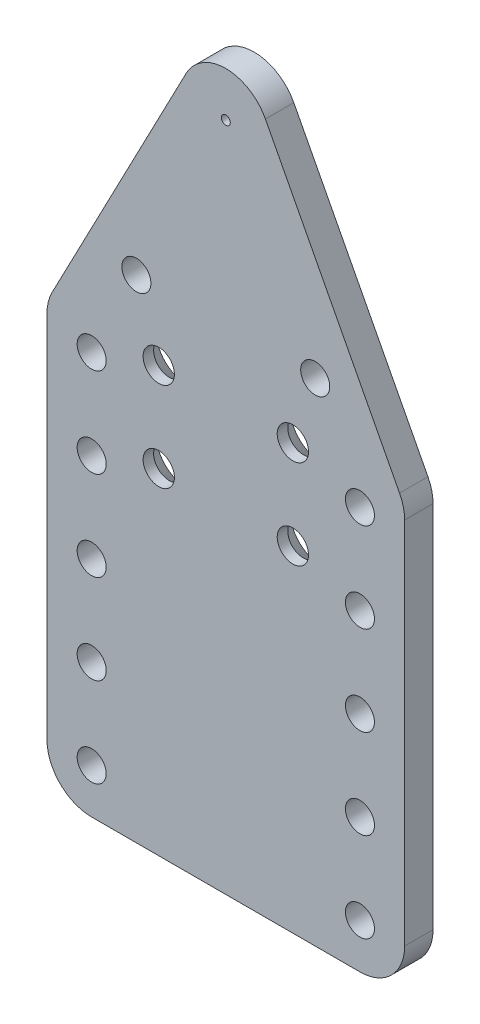
ISO-10303-21;
HEADER;
FILE_DESCRIPTION(('STEP AP214'),'2;1');
FILE_NAME('part.step','',(''),(''),'','','');
FILE_SCHEMA(('AUTOMOTIVE_DESIGN { 1 0 10303 214 1 1 1 1 }'));
ENDSEC;
DATA;
#1=APPLICATION_CONTEXT('core data for automotive mechanical design processes');
#2=APPLICATION_PROTOCOL_DEFINITION('international standard','automotive_design',2000,#1);
#3=PRODUCT_CONTEXT('',#1,'mechanical');
#4=PRODUCT('Part','Part','',(#3));
#5=PRODUCT_RELATED_PRODUCT_CATEGORY('part','',(#4));
#6=PRODUCT_DEFINITION_FORMATION('','',#4);
#7=PRODUCT_DEFINITION_CONTEXT('part definition',#1,'design');
#8=PRODUCT_DEFINITION('design','',#6,#7);
#9=PRODUCT_DEFINITION_SHAPE('','',#8);
#10=(LENGTH_UNIT() NAMED_UNIT(*) SI_UNIT(.MILLI.,.METRE.));
#11=(NAMED_UNIT(*) PLANE_ANGLE_UNIT() SI_UNIT($,.RADIAN.));
#12=(NAMED_UNIT(*) SI_UNIT($,.STERADIAN.) SOLID_ANGLE_UNIT());
#13=UNCERTAINTY_MEASURE_WITH_UNIT(LENGTH_MEASURE(1.E-05),#10,'distance_accuracy_value','');
#14=(GEOMETRIC_REPRESENTATION_CONTEXT(3) GLOBAL_UNCERTAINTY_ASSIGNED_CONTEXT((#13)) GLOBAL_UNIT_ASSIGNED_CONTEXT((#10,
#11,#12)) REPRESENTATION_CONTEXT('',''));
#15=CARTESIAN_POINT('',(0.,0.,0.));
#16=DIRECTION('',(0.,0.,1.));
#17=DIRECTION('',(1.,0.,0.));
#18=AXIS2_PLACEMENT_3D('',#15,#16,#17);
#19=CARTESIAN_POINT('',(0.,102.5,6.35));
#20=DIRECTION('',(0.,0.,1.));
#21=DIRECTION('',(1.,0.,0.));
#22=AXIS2_PLACEMENT_3D('',#19,#20,#21);
#23=PLANE('',#22);
#24=CARTESIAN_POINT('',(0.,102.5,6.35));
#25=DIRECTION('',(0.,0.,1.));
#26=DIRECTION('',(1.,0.,0.));
#27=AXIS2_PLACEMENT_3D('',#24,#25,#26);
#28=CIRCLE('',#27,1.);
#29=CARTESIAN_POINT('',(1.,102.5,6.35));
#30=VERTEX_POINT('',#29);
#31=EDGE_CURVE('E525',#30,#30,#28,.T.);
#32=ORIENTED_EDGE('',*,*,#31,.F.);
#33=EDGE_LOOP('',(#32));
#34=FACE_BOUND('',#33,.T.);
#35=CARTESIAN_POINT('',(20.,62.5,6.35));
#36=DIRECTION('',(0.,0.,1.));
#37=DIRECTION('',(1.,0.,0.));
#38=AXIS2_PLACEMENT_3D('',#35,#36,#37);
#39=CIRCLE('',#38,3.25);
#40=CARTESIAN_POINT('',(23.25,62.5,6.35));
#41=VERTEX_POINT('',#40);
#42=EDGE_CURVE('E519',#41,#41,#39,.T.);
#43=ORIENTED_EDGE('',*,*,#42,.F.);
#44=EDGE_LOOP('',(#43));
#45=FACE_BOUND('',#44,.T.);
#46=CARTESIAN_POINT('',(-20.,62.5,6.35));
#47=DIRECTION('',(0.,0.,1.));
#48=DIRECTION('',(1.,0.,0.));
#49=AXIS2_PLACEMENT_3D('',#46,#47,#48);
#50=CIRCLE('',#49,3.25);
#51=CARTESIAN_POINT('',(-16.75,62.5,6.35));
#52=VERTEX_POINT('',#51);
#53=EDGE_CURVE('E513',#52,#52,#50,.T.);
#54=ORIENTED_EDGE('',*,*,#53,.F.);
#55=EDGE_LOOP('',(#54));
#56=FACE_BOUND('',#55,.T.);
#57=CARTESIAN_POINT('',(30.,-17.5,6.35));
#58=DIRECTION('',(0.,0.,1.));
#59=DIRECTION('',(1.,0.,0.));
#60=AXIS2_PLACEMENT_3D('',#57,#58,#59);
#61=CIRCLE('',#60,3.24999999999999);
#62=CARTESIAN_POINT('',(33.25,-17.5,6.35));
#63=VERTEX_POINT('',#62);
#64=EDGE_CURVE('E507',#63,#63,#61,.T.);
#65=ORIENTED_EDGE('',*,*,#64,.F.);
#66=EDGE_LOOP('',(#65));
#67=FACE_BOUND('',#66,.T.);
#68=CARTESIAN_POINT('',(-30.,-17.5,6.35));
#69=DIRECTION('',(0.,0.,1.));
#70=DIRECTION('',(1.,0.,0.));
#71=AXIS2_PLACEMENT_3D('',#68,#69,#70);
#72=CIRCLE('',#71,3.25);
#73=CARTESIAN_POINT('',(-26.75,-17.5,6.35));
#74=VERTEX_POINT('',#73);
#75=EDGE_CURVE('E499',#74,#74,#72,.T.);
#76=ORIENTED_EDGE('',*,*,#75,.F.);
#77=EDGE_LOOP('',(#76));
#78=FACE_BOUND('',#77,.T.);
#79=CARTESIAN_POINT('',(-30.,-37.5,6.35));
#80=DIRECTION('',(0.,0.,1.));
#81=DIRECTION('',(1.,0.,0.));
#82=AXIS2_PLACEMENT_3D('',#79,#80,#81);
#83=CIRCLE('',#82,3.25);
#84=CARTESIAN_POINT('',(-26.75,-37.5,6.35));
#85=VERTEX_POINT('',#84);
#86=EDGE_CURVE('E495',#85,#85,#83,.T.);
#87=ORIENTED_EDGE('',*,*,#86,.F.);
#88=EDGE_LOOP('',(#87));
#89=FACE_BOUND('',#88,.T.);
#90=CARTESIAN_POINT('',(30.,-37.5,6.35));
#91=DIRECTION('',(0.,0.,1.));
#92=DIRECTION('',(1.,0.,0.));
#93=AXIS2_PLACEMENT_3D('',#90,#91,#92);
#94=CIRCLE('',#93,3.24999999999999);
#95=CARTESIAN_POINT('',(33.25,-37.5,6.35));
#96=VERTEX_POINT('',#95);
#97=EDGE_CURVE('E489',#96,#96,#94,.T.);
#98=ORIENTED_EDGE('',*,*,#97,.F.);
#99=EDGE_LOOP('',(#98));
#100=FACE_BOUND('',#99,.T.);
#101=CARTESIAN_POINT('',(-15.,27.5,6.35));
#102=DIRECTION('',(0.,0.,1.));
#103=DIRECTION('',(1.,0.,0.));
#104=AXIS2_PLACEMENT_3D('',#101,#102,#103);
#105=CIRCLE('',#104,3.5);
#106=CARTESIAN_POINT('',(-11.5,27.5,6.35));
#107=VERTEX_POINT('',#106);
#108=EDGE_CURVE('E434',#107,#107,#105,.T.);
#109=ORIENTED_EDGE('',*,*,#108,.F.);
#110=EDGE_LOOP('',(#109));
#111=FACE_BOUND('',#110,.T.);
#112=CARTESIAN_POINT('',(-15.,47.5,6.35));
#113=DIRECTION('',(0.,0.,1.));
#114=DIRECTION('',(1.,0.,0.));
#115=AXIS2_PLACEMENT_3D('',#112,#113,#114);
#116=CIRCLE('',#115,3.50000000000001);
#117=CARTESIAN_POINT('',(-11.5,47.5,6.35));
#118=VERTEX_POINT('',#117);
#119=EDGE_CURVE('E433',#118,#118,#116,.T.);
#120=ORIENTED_EDGE('',*,*,#119,.F.);
#121=EDGE_LOOP('',(#120));
#122=FACE_BOUND('',#121,.T.);
#123=DIRECTION('',(0.,1.,0.));
#124=VECTOR('',#123,1.);
#125=CARTESIAN_POINT('',(40.,-47.5,6.35));
#126=LINE('',#125,#124);
#127=CARTESIAN_POINT('',(40.,-37.5,6.35));
#128=VERTEX_POINT('',#127);
#129=CARTESIAN_POINT('',(40.,45.0463759529263,6.35));
#130=VERTEX_POINT('',#129);
#131=EDGE_CURVE('E157',#128,#130,#126,.T.);
#132=ORIENTED_EDGE('',*,*,#131,.T.);
#133=CARTESIAN_POINT('',(30.,45.0463759529263,6.35));
#134=DIRECTION('',(0.,0.,1.));
#135=DIRECTION('',(1.,0.,0.));
#136=AXIS2_PLACEMENT_3D('',#133,#134,#135);
#137=CIRCLE('',#136,10.);
#138=CARTESIAN_POINT('',(38.8643170009627,49.6749701354446,6.35));
#139=VERTEX_POINT('',#138);
#140=EDGE_CURVE('E127',#130,#139,#137,.T.);
#141=ORIENTED_EDGE('',*,*,#140,.T.);
#142=DIRECTION('',(-0.462859418251836,0.886431700096275,0.));
#143=VECTOR('',#142,1.);
#144=CARTESIAN_POINT('',(8.86431700096275,107.128594182518,6.35));
#145=LINE('',#144,#143);
#146=CARTESIAN_POINT('',(8.86431700096275,107.128594182518,6.35));
#147=VERTEX_POINT('',#146);
#148=EDGE_CURVE('E119',#139,#147,#145,.T.);
#149=ORIENTED_EDGE('',*,*,#148,.T.);
#150=CARTESIAN_POINT('',(0.,102.5,6.35));
#151=DIRECTION('',(0.,0.,1.));
#152=DIRECTION('',(1.,0.,0.));
#153=AXIS2_PLACEMENT_3D('',#150,#151,#152);
#154=CIRCLE('',#153,10.);
#155=CARTESIAN_POINT('',(-8.86431700096275,107.128594182518,6.35));
#156=VERTEX_POINT('',#155);
#157=EDGE_CURVE('E124',#147,#156,#154,.T.);
#158=ORIENTED_EDGE('',*,*,#157,.T.);
#159=DIRECTION('',(-0.462859418251836,-0.886431700096275,0.));
#160=VECTOR('',#159,1.);
#161=CARTESIAN_POINT('',(-40.,47.5,6.35));
#162=LINE('',#161,#160);
#163=CARTESIAN_POINT('',(-38.8643170009627,49.6749701354447,6.35));
#164=VERTEX_POINT('',#163);
#165=EDGE_CURVE('E143',#156,#164,#162,.T.);
#166=ORIENTED_EDGE('',*,*,#165,.T.);
#167=CARTESIAN_POINT('',(-30.,45.0463759529263,6.35));
#168=DIRECTION('',(0.,0.,1.));
#169=DIRECTION('',(1.,0.,0.));
#170=AXIS2_PLACEMENT_3D('',#167,#168,#169);
#171=CIRCLE('',#170,10.);
#172=CARTESIAN_POINT('',(-40.,45.0463759529263,6.35));
#173=VERTEX_POINT('',#172);
#174=EDGE_CURVE('E231',#164,#173,#171,.T.);
#175=ORIENTED_EDGE('',*,*,#174,.T.);
#176=DIRECTION('',(0.,-1.,0.));
#177=VECTOR('',#176,1.);
#178=CARTESIAN_POINT('',(-40.,-47.5,6.35));
#179=LINE('',#178,#177);
#180=CARTESIAN_POINT('',(-40.,-37.5,6.35));
#181=VERTEX_POINT('',#180);
#182=EDGE_CURVE('E447',#173,#181,#179,.T.);
#183=ORIENTED_EDGE('',*,*,#182,.T.);
#184=CARTESIAN_POINT('',(-30.,-37.5,6.35));
#185=DIRECTION('',(0.,0.,1.));
#186=DIRECTION('',(1.,0.,0.));
#187=AXIS2_PLACEMENT_3D('',#184,#185,#186);
#188=CIRCLE('',#187,10.);
#189=CARTESIAN_POINT('',(-30.,-47.5,6.35));
#190=VERTEX_POINT('',#189);
#191=EDGE_CURVE('E64',#181,#190,#188,.T.);
#192=ORIENTED_EDGE('',*,*,#191,.T.);
#193=DIRECTION('',(1.,0.,0.));
#194=VECTOR('',#193,1.);
#195=CARTESIAN_POINT('',(-40.,-47.5,6.35));
#196=LINE('',#195,#194);
#197=CARTESIAN_POINT('',(30.,-47.5,6.35));
#198=VERTEX_POINT('',#197);
#199=EDGE_CURVE('E450',#190,#198,#196,.T.);
#200=ORIENTED_EDGE('',*,*,#199,.T.);
#201=CARTESIAN_POINT('',(30.,-37.5,6.35));
#202=DIRECTION('',(0.,0.,1.));
#203=DIRECTION('',(1.,0.,0.));
#204=AXIS2_PLACEMENT_3D('',#201,#202,#203);
#205=CIRCLE('',#204,10.);
#206=EDGE_CURVE('E228',#198,#128,#205,.T.);
#207=ORIENTED_EDGE('',*,*,#206,.T.);
#208=EDGE_LOOP('',(#132,#141,#149,#158,#166,#175,#183,#192,#200,#207));
#209=FACE_BOUND('',#208,.T.);
#210=CARTESIAN_POINT('',(15.,47.5,6.35));
#211=DIRECTION('',(0.,0.,1.));
#212=DIRECTION('',(1.,0.,0.));
#213=AXIS2_PLACEMENT_3D('',#210,#211,#212);
#214=CIRCLE('',#213,3.5);
#215=CARTESIAN_POINT('',(18.5,47.5,6.35));
#216=VERTEX_POINT('',#215);
#217=EDGE_CURVE('E431',#216,#216,#214,.T.);
#218=ORIENTED_EDGE('',*,*,#217,.F.);
#219=EDGE_LOOP('',(#218));
#220=FACE_BOUND('',#219,.T.);
#221=CARTESIAN_POINT('',(15.,27.5,6.35));
#222=DIRECTION('',(0.,0.,1.));
#223=DIRECTION('',(1.,0.,0.));
#224=AXIS2_PLACEMENT_3D('',#221,#222,#223);
#225=CIRCLE('',#224,3.5);
#226=CARTESIAN_POINT('',(18.5,27.5,6.35));
#227=VERTEX_POINT('',#226);
#228=EDGE_CURVE('E441',#227,#227,#225,.T.);
#229=ORIENTED_EDGE('',*,*,#228,.F.);
#230=EDGE_LOOP('',(#229));
#231=FACE_BOUND('',#230,.T.);
#232=CARTESIAN_POINT('',(-30.,2.5,6.35));
#233=DIRECTION('',(0.,0.,1.));
#234=DIRECTION('',(1.,0.,0.));
#235=AXIS2_PLACEMENT_3D('',#232,#233,#234);
#236=CIRCLE('',#235,3.25);
#237=CARTESIAN_POINT('',(-26.75,2.5,6.35));
#238=VERTEX_POINT('',#237);
#239=EDGE_CURVE('E155',#238,#238,#236,.T.);
#240=ORIENTED_EDGE('',*,*,#239,.F.);
#241=EDGE_LOOP('',(#240));
#242=FACE_BOUND('',#241,.T.);
#243=CARTESIAN_POINT('',(-30.,22.5,6.35));
#244=DIRECTION('',(0.,0.,1.));
#245=DIRECTION('',(1.,0.,0.));
#246=AXIS2_PLACEMENT_3D('',#243,#244,#245);
#247=CIRCLE('',#246,3.25);
#248=CARTESIAN_POINT('',(-26.75,22.5,6.35));
#249=VERTEX_POINT('',#248);
#250=EDGE_CURVE('E168',#249,#249,#247,.T.);
#251=ORIENTED_EDGE('',*,*,#250,.F.);
#252=EDGE_LOOP('',(#251));
#253=FACE_BOUND('',#252,.T.);
#254=CARTESIAN_POINT('',(-30.,42.5,6.35));
#255=DIRECTION('',(0.,0.,1.));
#256=DIRECTION('',(1.,0.,0.));
#257=AXIS2_PLACEMENT_3D('',#254,#255,#256);
#258=CIRCLE('',#257,3.25);
#259=CARTESIAN_POINT('',(-26.75,42.5,6.35));
#260=VERTEX_POINT('',#259);
#261=EDGE_CURVE('E176',#260,#260,#258,.T.);
#262=ORIENTED_EDGE('',*,*,#261,.F.);
#263=EDGE_LOOP('',(#262));
#264=FACE_BOUND('',#263,.T.);
#265=CARTESIAN_POINT('',(30.,2.5,6.35));
#266=DIRECTION('',(0.,0.,1.));
#267=DIRECTION('',(1.,0.,0.));
#268=AXIS2_PLACEMENT_3D('',#265,#266,#267);
#269=CIRCLE('',#268,3.24999999999999);
#270=CARTESIAN_POINT('',(33.25,2.5,6.35));
#271=VERTEX_POINT('',#270);
#272=EDGE_CURVE('E184',#271,#271,#269,.T.);
#273=ORIENTED_EDGE('',*,*,#272,.F.);
#274=EDGE_LOOP('',(#273));
#275=FACE_BOUND('',#274,.T.);
#276=CARTESIAN_POINT('',(30.,22.5,6.35));
#277=DIRECTION('',(0.,0.,1.));
#278=DIRECTION('',(1.,0.,0.));
#279=AXIS2_PLACEMENT_3D('',#276,#277,#278);
#280=CIRCLE('',#279,3.24999999999999);
#281=CARTESIAN_POINT('',(33.25,22.5,6.35));
#282=VERTEX_POINT('',#281);
#283=EDGE_CURVE('E192',#282,#282,#280,.T.);
#284=ORIENTED_EDGE('',*,*,#283,.F.);
#285=EDGE_LOOP('',(#284));
#286=FACE_BOUND('',#285,.T.);
#287=CARTESIAN_POINT('',(30.,42.5,6.35));
#288=DIRECTION('',(0.,0.,1.));
#289=DIRECTION('',(1.,0.,0.));
#290=AXIS2_PLACEMENT_3D('',#287,#288,#289);
#291=CIRCLE('',#290,3.24999999999999);
#292=CARTESIAN_POINT('',(33.25,42.5,6.35));
#293=VERTEX_POINT('',#292);
#294=EDGE_CURVE('E200',#293,#293,#291,.T.);
#295=ORIENTED_EDGE('',*,*,#294,.F.);
#296=EDGE_LOOP('',(#295));
#297=FACE_BOUND('',#296,.T.);
#298=ADVANCED_FACE('F41',(#34,#45,#56,#67,#78,#89,#100,#111,#122,#209,#220,#231,#242,#253,#264,
#275,#286,#297),#23,.T.);
#299=CARTESIAN_POINT('',(0.,102.5,0.));
#300=DIRECTION('',(0.,0.,1.));
#301=DIRECTION('',(1.,0.,0.));
#302=AXIS2_PLACEMENT_3D('',#299,#300,#301);
#303=PLANE('',#302);
#304=CARTESIAN_POINT('',(-15.,47.5,0.));
#305=DIRECTION('',(0.,0.,1.));
#306=DIRECTION('',(1.,0.,0.));
#307=AXIS2_PLACEMENT_3D('',#304,#305,#306);
#308=CIRCLE('',#307,6.97714695126489);
#309=CARTESIAN_POINT('',(-8.02285304873511,47.5,0.));
#310=VERTEX_POINT('',#309);
#311=EDGE_CURVE('E264',#310,#310,#308,.T.);
#312=ORIENTED_EDGE('',*,*,#311,.T.);
#313=EDGE_LOOP('',(#312));
#314=FACE_BOUND('',#313,.T.);
#315=CARTESIAN_POINT('',(15.,47.5,0.));
#316=DIRECTION('',(0.,0.,1.));
#317=DIRECTION('',(1.,0.,0.));
#318=AXIS2_PLACEMENT_3D('',#315,#316,#317);
#319=CIRCLE('',#318,6.97714695126489);
#320=CARTESIAN_POINT('',(21.9771469512649,47.5,0.));
#321=VERTEX_POINT('',#320);
#322=EDGE_CURVE('E260',#321,#321,#319,.T.);
#323=ORIENTED_EDGE('',*,*,#322,.T.);
#324=EDGE_LOOP('',(#323));
#325=FACE_BOUND('',#324,.T.);
#326=CARTESIAN_POINT('',(15.,27.5,0.));
#327=DIRECTION('',(0.,0.,1.));
#328=DIRECTION('',(1.,0.,0.));
#329=AXIS2_PLACEMENT_3D('',#326,#327,#328);
#330=CIRCLE('',#329,6.97714695126489);
#331=CARTESIAN_POINT('',(21.9771469512649,27.5,0.));
#332=VERTEX_POINT('',#331);
#333=EDGE_CURVE('E256',#332,#332,#330,.T.);
#334=ORIENTED_EDGE('',*,*,#333,.T.);
#335=EDGE_LOOP('',(#334));
#336=FACE_BOUND('',#335,.T.);
#337=CARTESIAN_POINT('',(-15.,27.5,0.));
#338=DIRECTION('',(0.,0.,1.));
#339=DIRECTION('',(1.,0.,0.));
#340=AXIS2_PLACEMENT_3D('',#337,#338,#339);
#341=CIRCLE('',#340,6.97714695126489);
#342=CARTESIAN_POINT('',(-8.02285304873511,27.5,0.));
#343=VERTEX_POINT('',#342);
#344=EDGE_CURVE('E252',#343,#343,#341,.T.);
#345=ORIENTED_EDGE('',*,*,#344,.T.);
#346=EDGE_LOOP('',(#345));
#347=FACE_BOUND('',#346,.T.);
#348=CARTESIAN_POINT('',(0.,102.5,0.));
#349=DIRECTION('',(0.,0.,1.));
#350=DIRECTION('',(1.,0.,0.));
#351=AXIS2_PLACEMENT_3D('',#348,#349,#350);
#352=CIRCLE('',#351,1.);
#353=CARTESIAN_POINT('',(1.,102.5,0.));
#354=VERTEX_POINT('',#353);
#355=EDGE_CURVE('E298',#354,#354,#352,.T.);
#356=ORIENTED_EDGE('',*,*,#355,.T.);
#357=EDGE_LOOP('',(#356));
#358=FACE_BOUND('',#357,.T.);
#359=CARTESIAN_POINT('',(20.,62.5,0.));
#360=DIRECTION('',(0.,0.,1.));
#361=DIRECTION('',(1.,0.,0.));
#362=AXIS2_PLACEMENT_3D('',#359,#360,#361);
#363=CIRCLE('',#362,3.25);
#364=CARTESIAN_POINT('',(23.25,62.5,0.));
#365=VERTEX_POINT('',#364);
#366=EDGE_CURVE('E302',#365,#365,#363,.T.);
#367=ORIENTED_EDGE('',*,*,#366,.T.);
#368=EDGE_LOOP('',(#367));
#369=FACE_BOUND('',#368,.T.);
#370=CARTESIAN_POINT('',(-20.,62.5,0.));
#371=DIRECTION('',(0.,0.,1.));
#372=DIRECTION('',(1.,0.,0.));
#373=AXIS2_PLACEMENT_3D('',#370,#371,#372);
#374=CIRCLE('',#373,3.25);
#375=CARTESIAN_POINT('',(-16.75,62.5,0.));
#376=VERTEX_POINT('',#375);
#377=EDGE_CURVE('E306',#376,#376,#374,.T.);
#378=ORIENTED_EDGE('',*,*,#377,.T.);
#379=EDGE_LOOP('',(#378));
#380=FACE_BOUND('',#379,.T.);
#381=CARTESIAN_POINT('',(30.,-17.5,0.));
#382=DIRECTION('',(0.,0.,1.));
#383=DIRECTION('',(1.,0.,0.));
#384=AXIS2_PLACEMENT_3D('',#381,#382,#383);
#385=CIRCLE('',#384,3.24999999999999);
#386=CARTESIAN_POINT('',(33.25,-17.5,0.));
#387=VERTEX_POINT('',#386);
#388=EDGE_CURVE('E310',#387,#387,#385,.T.);
#389=ORIENTED_EDGE('',*,*,#388,.T.);
#390=EDGE_LOOP('',(#389));
#391=FACE_BOUND('',#390,.T.);
#392=CARTESIAN_POINT('',(-30.,-17.5,0.));
#393=DIRECTION('',(0.,0.,1.));
#394=DIRECTION('',(1.,0.,0.));
#395=AXIS2_PLACEMENT_3D('',#392,#393,#394);
#396=CIRCLE('',#395,3.25);
#397=CARTESIAN_POINT('',(-26.75,-17.5,0.));
#398=VERTEX_POINT('',#397);
#399=EDGE_CURVE('E314',#398,#398,#396,.T.);
#400=ORIENTED_EDGE('',*,*,#399,.T.);
#401=EDGE_LOOP('',(#400));
#402=FACE_BOUND('',#401,.T.);
#403=CARTESIAN_POINT('',(-30.,-37.5,0.));
#404=DIRECTION('',(0.,0.,1.));
#405=DIRECTION('',(1.,0.,0.));
#406=AXIS2_PLACEMENT_3D('',#403,#404,#405);
#407=CIRCLE('',#406,3.25);
#408=CARTESIAN_POINT('',(-26.75,-37.5,0.));
#409=VERTEX_POINT('',#408);
#410=EDGE_CURVE('E318',#409,#409,#407,.T.);
#411=ORIENTED_EDGE('',*,*,#410,.T.);
#412=EDGE_LOOP('',(#411));
#413=FACE_BOUND('',#412,.T.);
#414=CARTESIAN_POINT('',(30.,-37.5,0.));
#415=DIRECTION('',(0.,0.,1.));
#416=DIRECTION('',(1.,0.,0.));
#417=AXIS2_PLACEMENT_3D('',#414,#415,#416);
#418=CIRCLE('',#417,3.24999999999999);
#419=CARTESIAN_POINT('',(33.25,-37.5,0.));
#420=VERTEX_POINT('',#419);
#421=EDGE_CURVE('E322',#420,#420,#418,.T.);
#422=ORIENTED_EDGE('',*,*,#421,.T.);
#423=EDGE_LOOP('',(#422));
#424=FACE_BOUND('',#423,.T.);
#425=DIRECTION('',(-0.462859418251836,0.886431700096275,0.));
#426=VECTOR('',#425,1.);
#427=CARTESIAN_POINT('',(8.86431700096275,107.128594182518,0.));
#428=LINE('',#427,#426);
#429=CARTESIAN_POINT('',(38.8643170009627,49.6749701354446,0.));
#430=VERTEX_POINT('',#429);
#431=CARTESIAN_POINT('',(8.86431700096275,107.128594182518,0.));
#432=VERTEX_POINT('',#431);
#433=EDGE_CURVE('E147',#430,#432,#428,.T.);
#434=ORIENTED_EDGE('',*,*,#433,.F.);
#435=CARTESIAN_POINT('',(30.,45.0463759529263,0.));
#436=DIRECTION('',(0.,0.,1.));
#437=DIRECTION('',(1.,0.,0.));
#438=AXIS2_PLACEMENT_3D('',#435,#436,#437);
#439=CIRCLE('',#438,10.);
#440=CARTESIAN_POINT('',(40.,45.0463759529263,0.));
#441=VERTEX_POINT('',#440);
#442=EDGE_CURVE('E216',#430,#441,#439,.F.);
#443=ORIENTED_EDGE('',*,*,#442,.T.);
#444=DIRECTION('',(0.,1.,0.));
#445=VECTOR('',#444,1.);
#446=CARTESIAN_POINT('',(40.,-47.5,0.));
#447=LINE('',#446,#445);
#448=CARTESIAN_POINT('',(40.,-37.5,0.));
#449=VERTEX_POINT('',#448);
#450=EDGE_CURVE('E133',#449,#441,#447,.T.);
#451=ORIENTED_EDGE('',*,*,#450,.F.);
#452=CARTESIAN_POINT('',(30.,-37.5,0.));
#453=DIRECTION('',(0.,0.,1.));
#454=DIRECTION('',(1.,0.,0.));
#455=AXIS2_PLACEMENT_3D('',#452,#453,#454);
#456=CIRCLE('',#455,10.);
#457=CARTESIAN_POINT('',(30.,-47.5,0.));
#458=VERTEX_POINT('',#457);
#459=EDGE_CURVE('E210',#449,#458,#456,.F.);
#460=ORIENTED_EDGE('',*,*,#459,.T.);
#461=DIRECTION('',(1.,0.,0.));
#462=VECTOR('',#461,1.);
#463=CARTESIAN_POINT('',(-40.,-47.5,0.));
#464=LINE('',#463,#462);
#465=CARTESIAN_POINT('',(-30.,-47.5,0.));
#466=VERTEX_POINT('',#465);
#467=EDGE_CURVE('E468',#466,#458,#464,.T.);
#468=ORIENTED_EDGE('',*,*,#467,.F.);
#469=CARTESIAN_POINT('',(-30.,-37.5,0.));
#470=DIRECTION('',(0.,0.,1.));
#471=DIRECTION('',(1.,0.,0.));
#472=AXIS2_PLACEMENT_3D('',#469,#470,#471);
#473=CIRCLE('',#472,10.);
#474=CARTESIAN_POINT('',(-40.,-37.5,0.));
#475=VERTEX_POINT('',#474);
#476=EDGE_CURVE('E207',#466,#475,#473,.F.);
#477=ORIENTED_EDGE('',*,*,#476,.T.);
#478=DIRECTION('',(0.,-1.,0.));
#479=VECTOR('',#478,1.);
#480=CARTESIAN_POINT('',(-40.,-47.5,0.));
#481=LINE('',#480,#479);
#482=CARTESIAN_POINT('',(-40.,45.0463759529263,0.));
#483=VERTEX_POINT('',#482);
#484=EDGE_CURVE('E464',#483,#475,#481,.T.);
#485=ORIENTED_EDGE('',*,*,#484,.F.);
#486=CARTESIAN_POINT('',(-30.,45.0463759529263,0.));
#487=DIRECTION('',(0.,0.,1.));
#488=DIRECTION('',(1.,0.,0.));
#489=AXIS2_PLACEMENT_3D('',#486,#487,#488);
#490=CIRCLE('',#489,10.);
#491=CARTESIAN_POINT('',(-38.8643170009627,49.6749701354447,0.));
#492=VERTEX_POINT('',#491);
#493=EDGE_CURVE('E213',#483,#492,#490,.F.);
#494=ORIENTED_EDGE('',*,*,#493,.T.);
#495=DIRECTION('',(-0.462859418251836,-0.886431700096275,0.));
#496=VECTOR('',#495,1.);
#497=CARTESIAN_POINT('',(-40.,47.5,0.));
#498=LINE('',#497,#496);
#499=CARTESIAN_POINT('',(-8.86431700096275,107.128594182518,0.));
#500=VERTEX_POINT('',#499);
#501=EDGE_CURVE('E460',#500,#492,#498,.T.);
#502=ORIENTED_EDGE('',*,*,#501,.F.);
#503=CARTESIAN_POINT('',(0.,102.5,0.));
#504=DIRECTION('',(0.,0.,1.));
#505=DIRECTION('',(1.,0.,0.));
#506=AXIS2_PLACEMENT_3D('',#503,#504,#505);
#507=CIRCLE('',#506,10.);
#508=EDGE_CURVE('E457',#432,#500,#507,.T.);
#509=ORIENTED_EDGE('',*,*,#508,.F.);
#510=EDGE_LOOP('',(#434,#443,#451,#460,#468,#477,#485,#494,#502,#509));
#511=FACE_BOUND('',#510,.T.);
#512=CARTESIAN_POINT('',(-30.,2.5,0.));
#513=DIRECTION('',(0.,0.,1.));
#514=DIRECTION('',(1.,0.,0.));
#515=AXIS2_PLACEMENT_3D('',#512,#513,#514);
#516=CIRCLE('',#515,3.25);
#517=CARTESIAN_POINT('',(-26.75,2.5,0.));
#518=VERTEX_POINT('',#517);
#519=EDGE_CURVE('E150',#518,#518,#516,.T.);
#520=ORIENTED_EDGE('',*,*,#519,.T.);
#521=EDGE_LOOP('',(#520));
#522=FACE_BOUND('',#521,.T.);
#523=CARTESIAN_POINT('',(-30.,22.5,0.));
#524=DIRECTION('',(0.,0.,1.));
#525=DIRECTION('',(1.,0.,0.));
#526=AXIS2_PLACEMENT_3D('',#523,#524,#525);
#527=CIRCLE('',#526,3.25);
#528=CARTESIAN_POINT('',(-26.75,22.5,0.));
#529=VERTEX_POINT('',#528);
#530=EDGE_CURVE('E164',#529,#529,#527,.T.);
#531=ORIENTED_EDGE('',*,*,#530,.T.);
#532=EDGE_LOOP('',(#531));
#533=FACE_BOUND('',#532,.T.);
#534=CARTESIAN_POINT('',(-30.,42.5,0.));
#535=DIRECTION('',(0.,0.,1.));
#536=DIRECTION('',(1.,0.,0.));
#537=AXIS2_PLACEMENT_3D('',#534,#535,#536);
#538=CIRCLE('',#537,3.25);
#539=CARTESIAN_POINT('',(-26.75,42.5,0.));
#540=VERTEX_POINT('',#539);
#541=EDGE_CURVE('E172',#540,#540,#538,.T.);
#542=ORIENTED_EDGE('',*,*,#541,.T.);
#543=EDGE_LOOP('',(#542));
#544=FACE_BOUND('',#543,.T.);
#545=CARTESIAN_POINT('',(30.,2.5,0.));
#546=DIRECTION('',(0.,0.,1.));
#547=DIRECTION('',(1.,0.,0.));
#548=AXIS2_PLACEMENT_3D('',#545,#546,#547);
#549=CIRCLE('',#548,3.24999999999999);
#550=CARTESIAN_POINT('',(33.25,2.5,0.));
#551=VERTEX_POINT('',#550);
#552=EDGE_CURVE('E180',#551,#551,#549,.T.);
#553=ORIENTED_EDGE('',*,*,#552,.T.);
#554=EDGE_LOOP('',(#553));
#555=FACE_BOUND('',#554,.T.);
#556=CARTESIAN_POINT('',(30.,22.5,0.));
#557=DIRECTION('',(0.,0.,1.));
#558=DIRECTION('',(1.,0.,0.));
#559=AXIS2_PLACEMENT_3D('',#556,#557,#558);
#560=CIRCLE('',#559,3.24999999999999);
#561=CARTESIAN_POINT('',(33.25,22.5,0.));
#562=VERTEX_POINT('',#561);
#563=EDGE_CURVE('E188',#562,#562,#560,.T.);
#564=ORIENTED_EDGE('',*,*,#563,.T.);
#565=EDGE_LOOP('',(#564));
#566=FACE_BOUND('',#565,.T.);
#567=CARTESIAN_POINT('',(30.,42.5,0.));
#568=DIRECTION('',(0.,0.,1.));
#569=DIRECTION('',(1.,0.,0.));
#570=AXIS2_PLACEMENT_3D('',#567,#568,#569);
#571=CIRCLE('',#570,3.24999999999999);
#572=CARTESIAN_POINT('',(33.25,42.5,0.));
#573=VERTEX_POINT('',#572);
#574=EDGE_CURVE('E196',#573,#573,#571,.T.);
#575=ORIENTED_EDGE('',*,*,#574,.T.);
#576=EDGE_LOOP('',(#575));
#577=FACE_BOUND('',#576,.T.);
#578=ADVANCED_FACE('F288',(#314,#325,#336,#347,#358,#369,#380,#391,#402,#413,#424,#511,#522,
#533,#544,#555,#566,#577),#303,.F.);
#579=CARTESIAN_POINT('',(8.86431700096275,107.128594182518,6.35));
#580=DIRECTION('',(-0.886431700096275,-0.462859418251836,0.));
#581=DIRECTION('',(0.462859418251836,-0.886431700096275,0.));
#582=AXIS2_PLACEMENT_3D('',#579,#580,#581);
#583=PLANE('',#582);
#584=ORIENTED_EDGE('',*,*,#148,.F.);
#585=DIRECTION('',(0.,0.,-1.));
#586=VECTOR('',#585,1.);
#587=CARTESIAN_POINT('',(38.8643170009627,49.6749701354446,6.35));
#588=LINE('',#587,#586);
#589=EDGE_CURVE('E204',#139,#430,#588,.T.);
#590=ORIENTED_EDGE('',*,*,#589,.T.);
#591=ORIENTED_EDGE('',*,*,#433,.T.);
#592=DIRECTION('',(0.,0.,-1.));
#593=VECTOR('',#592,1.);
#594=CARTESIAN_POINT('',(8.86431700096275,107.128594182518,6.35));
#595=LINE('',#594,#593);
#596=EDGE_CURVE('E138',#147,#432,#595,.T.);
#597=ORIENTED_EDGE('',*,*,#596,.F.);
#598=EDGE_LOOP('',(#584,#590,#591,#597));
#599=FACE_BOUND('',#598,.T.);
#600=ADVANCED_FACE('F145',(#599),#583,.F.);
#601=CARTESIAN_POINT('',(0.,102.5,6.35));
#602=DIRECTION('',(0.,0.,-1.));
#603=DIRECTION('',(-1.,0.,0.));
#604=AXIS2_PLACEMENT_3D('',#601,#602,#603);
#605=CYLINDRICAL_SURFACE('',#604,10.);
#606=ORIENTED_EDGE('',*,*,#508,.T.);
#607=DIRECTION('',(0.,0.,-1.));
#608=VECTOR('',#607,1.);
#609=CARTESIAN_POINT('',(-8.86431700096275,107.128594182518,6.35));
#610=LINE('',#609,#608);
#611=EDGE_CURVE('E140',#156,#500,#610,.T.);
#612=ORIENTED_EDGE('',*,*,#611,.F.);
#613=ORIENTED_EDGE('',*,*,#157,.F.);
#614=ORIENTED_EDGE('',*,*,#596,.T.);
#615=EDGE_LOOP('',(#606,#612,#613,#614));
#616=FACE_BOUND('',#615,.T.);
#617=ADVANCED_FACE('F137',(#616),#605,.T.);
#618=CARTESIAN_POINT('',(-40.,47.5,6.35));
#619=DIRECTION('',(0.886431700096275,-0.462859418251836,0.));
#620=DIRECTION('',(0.462859418251836,0.886431700096275,0.));
#621=AXIS2_PLACEMENT_3D('',#618,#619,#620);
#622=PLANE('',#621);
#623=ORIENTED_EDGE('',*,*,#501,.T.);
#624=DIRECTION('',(0.,0.,-1.));
#625=VECTOR('',#624,1.);
#626=CARTESIAN_POINT('',(-38.8643170009627,49.6749701354447,6.35));
#627=LINE('',#626,#625);
#628=EDGE_CURVE('E243',#492,#164,#627,.F.);
#629=ORIENTED_EDGE('',*,*,#628,.T.);
#630=ORIENTED_EDGE('',*,*,#165,.F.);
#631=ORIENTED_EDGE('',*,*,#611,.T.);
#632=EDGE_LOOP('',(#623,#629,#630,#631));
#633=FACE_BOUND('',#632,.T.);
#634=ADVANCED_FACE('F365',(#633),#622,.F.);
#635=CARTESIAN_POINT('',(-40.,-47.5,6.35));
#636=DIRECTION('',(1.,0.,0.));
#637=DIRECTION('',(0.,0.,-1.));
#638=AXIS2_PLACEMENT_3D('',#635,#636,#637);
#639=PLANE('',#638);
#640=ORIENTED_EDGE('',*,*,#182,.F.);
#641=DIRECTION('',(0.,0.,-1.));
#642=VECTOR('',#641,1.);
#643=CARTESIAN_POINT('',(-40.,45.0463759529263,6.35));
#644=LINE('',#643,#642);
#645=EDGE_CURVE('E239',#173,#483,#644,.T.);
#646=ORIENTED_EDGE('',*,*,#645,.T.);
#647=ORIENTED_EDGE('',*,*,#484,.T.);
#648=DIRECTION('',(0.,0.,-1.));
#649=VECTOR('',#648,1.);
#650=CARTESIAN_POINT('',(-40.,-37.5,6.35));
#651=LINE('',#650,#649);
#652=EDGE_CURVE('E236',#475,#181,#651,.F.);
#653=ORIENTED_EDGE('',*,*,#652,.T.);
#654=EDGE_LOOP('',(#640,#646,#647,#653));
#655=FACE_BOUND('',#654,.T.);
#656=ADVANCED_FACE('F362',(#655),#639,.F.);
#657=CARTESIAN_POINT('',(-40.,-47.5,6.35));
#658=DIRECTION('',(0.,1.,0.));
#659=DIRECTION('',(0.,0.,1.));
#660=AXIS2_PLACEMENT_3D('',#657,#658,#659);
#661=PLANE('',#660);
#662=ORIENTED_EDGE('',*,*,#467,.T.);
#663=DIRECTION('',(0.,0.,-1.));
#664=VECTOR('',#663,1.);
#665=CARTESIAN_POINT('',(30.,-47.5,6.35));
#666=LINE('',#665,#664);
#667=EDGE_CURVE('E57',#458,#198,#666,.F.);
#668=ORIENTED_EDGE('',*,*,#667,.T.);
#669=ORIENTED_EDGE('',*,*,#199,.F.);
#670=DIRECTION('',(0.,0.,-1.));
#671=VECTOR('',#670,1.);
#672=CARTESIAN_POINT('',(-30.,-47.5,6.35));
#673=LINE('',#672,#671);
#674=EDGE_CURVE('E246',#190,#466,#673,.T.);
#675=ORIENTED_EDGE('',*,*,#674,.T.);
#676=EDGE_LOOP('',(#662,#668,#669,#675));
#677=FACE_BOUND('',#676,.T.);
#678=ADVANCED_FACE('F358',(#677),#661,.F.);
#679=CARTESIAN_POINT('',(40.,-47.5,6.35));
#680=DIRECTION('',(-1.,0.,0.));
#681=DIRECTION('',(0.,0.,1.));
#682=AXIS2_PLACEMENT_3D('',#679,#680,#681);
#683=PLANE('',#682);
#684=ORIENTED_EDGE('',*,*,#450,.T.);
#685=DIRECTION('',(0.,0.,-1.));
#686=VECTOR('',#685,1.);
#687=CARTESIAN_POINT('',(40.,45.0463759529263,6.35));
#688=LINE('',#687,#686);
#689=EDGE_CURVE('E223',#441,#130,#688,.F.);
#690=ORIENTED_EDGE('',*,*,#689,.T.);
#691=ORIENTED_EDGE('',*,*,#131,.F.);
#692=DIRECTION('',(0.,0.,-1.));
#693=VECTOR('',#692,1.);
#694=CARTESIAN_POINT('',(40.,-37.5,6.35));
#695=LINE('',#694,#693);
#696=EDGE_CURVE('E219',#128,#449,#695,.T.);
#697=ORIENTED_EDGE('',*,*,#696,.T.);
#698=EDGE_LOOP('',(#684,#690,#691,#697));
#699=FACE_BOUND('',#698,.T.);
#700=ADVANCED_FACE('F355',(#699),#683,.F.);
#701=CARTESIAN_POINT('',(-15.,47.5,6.35));
#702=DIRECTION('',(0.,0.,-1.));
#703=DIRECTION('',(-1.,0.,0.));
#704=AXIS2_PLACEMENT_3D('',#701,#702,#703);
#705=CYLINDRICAL_SURFACE('',#704,3.50000000000001);
#706=CARTESIAN_POINT('',(-15.,47.5,4.));
#707=DIRECTION('',(0.,0.,1.));
#708=DIRECTION('',(1.,0.,0.));
#709=AXIS2_PLACEMENT_3D('',#706,#707,#708);
#710=CIRCLE('',#709,3.50000000000001);
#711=CARTESIAN_POINT('',(-11.5,47.5,4.));
#712=VERTEX_POINT('',#711);
#713=EDGE_CURVE('E268',#712,#712,#710,.F.);
#714=ORIENTED_EDGE('',*,*,#713,.T.);
#715=EDGE_LOOP('',(#714));
#716=FACE_BOUND('',#715,.T.);
#717=ORIENTED_EDGE('',*,*,#119,.T.);
#718=EDGE_LOOP('',(#717));
#719=FACE_BOUND('',#718,.T.);
#720=ADVANCED_FACE('F352',(#716,#719),#705,.F.);
#721=CARTESIAN_POINT('',(15.,47.5,6.35));
#722=DIRECTION('',(0.,0.,-1.));
#723=DIRECTION('',(-1.,0.,0.));
#724=AXIS2_PLACEMENT_3D('',#721,#722,#723);
#725=CYLINDRICAL_SURFACE('',#724,3.5);
#726=CARTESIAN_POINT('',(15.,47.5,4.00000000000001));
#727=DIRECTION('',(0.,0.,1.));
#728=DIRECTION('',(1.,0.,0.));
#729=AXIS2_PLACEMENT_3D('',#726,#727,#728);
#730=CIRCLE('',#729,3.5);
#731=CARTESIAN_POINT('',(18.5,47.5,4.00000000000001));
#732=VERTEX_POINT('',#731);
#733=EDGE_CURVE('E272',#732,#732,#730,.F.);
#734=ORIENTED_EDGE('',*,*,#733,.T.);
#735=EDGE_LOOP('',(#734));
#736=FACE_BOUND('',#735,.T.);
#737=ORIENTED_EDGE('',*,*,#217,.T.);
#738=EDGE_LOOP('',(#737));
#739=FACE_BOUND('',#738,.T.);
#740=ADVANCED_FACE('F425',(#736,#739),#725,.F.);
#741=CARTESIAN_POINT('',(-15.,27.5,6.35));
#742=DIRECTION('',(0.,0.,-1.));
#743=DIRECTION('',(-1.,0.,0.));
#744=AXIS2_PLACEMENT_3D('',#741,#742,#743);
#745=CYLINDRICAL_SURFACE('',#744,3.5);
#746=CARTESIAN_POINT('',(-15.,27.5,3.99999999999998));
#747=DIRECTION('',(0.,0.,1.));
#748=DIRECTION('',(1.,0.,0.));
#749=AXIS2_PLACEMENT_3D('',#746,#747,#748);
#750=CIRCLE('',#749,3.5);
#751=CARTESIAN_POINT('',(-11.5,27.5,3.99999999999998));
#752=VERTEX_POINT('',#751);
#753=EDGE_CURVE('E11',#752,#752,#750,.F.);
#754=ORIENTED_EDGE('',*,*,#753,.T.);
#755=EDGE_LOOP('',(#754));
#756=FACE_BOUND('',#755,.T.);
#757=ORIENTED_EDGE('',*,*,#108,.T.);
#758=EDGE_LOOP('',(#757));
#759=FACE_BOUND('',#758,.T.);
#760=ADVANCED_FACE('F428',(#756,#759),#745,.F.);
#761=CARTESIAN_POINT('',(15.,27.5,6.35));
#762=DIRECTION('',(0.,0.,-1.));
#763=DIRECTION('',(-1.,0.,0.));
#764=AXIS2_PLACEMENT_3D('',#761,#762,#763);
#765=CYLINDRICAL_SURFACE('',#764,3.5);
#766=CARTESIAN_POINT('',(15.,27.5,3.99999999999999));
#767=DIRECTION('',(0.,0.,1.));
#768=DIRECTION('',(1.,0.,0.));
#769=AXIS2_PLACEMENT_3D('',#766,#767,#768);
#770=CIRCLE('',#769,3.5);
#771=CARTESIAN_POINT('',(18.5,27.5,3.99999999999999));
#772=VERTEX_POINT('',#771);
#773=EDGE_CURVE('E50',#772,#772,#770,.F.);
#774=ORIENTED_EDGE('',*,*,#773,.T.);
#775=EDGE_LOOP('',(#774));
#776=FACE_BOUND('',#775,.T.);
#777=ORIENTED_EDGE('',*,*,#228,.T.);
#778=EDGE_LOOP('',(#777));
#779=FACE_BOUND('',#778,.T.);
#780=ADVANCED_FACE('F279',(#776,#779),#765,.F.);
#781=CARTESIAN_POINT('',(30.,-37.5,0.));
#782=DIRECTION('',(0.,0.,1.));
#783=DIRECTION('',(1.,0.,0.));
#784=AXIS2_PLACEMENT_3D('',#781,#782,#783);
#785=CYLINDRICAL_SURFACE('',#784,3.24999999999999);
#786=ORIENTED_EDGE('',*,*,#421,.F.);
#787=EDGE_LOOP('',(#786));
#788=FACE_BOUND('',#787,.T.);
#789=ORIENTED_EDGE('',*,*,#97,.T.);
#790=EDGE_LOOP('',(#789));
#791=FACE_BOUND('',#790,.T.);
#792=ADVANCED_FACE('F553',(#788,#791),#785,.F.);
#793=CARTESIAN_POINT('',(-30.,-37.5,0.));
#794=DIRECTION('',(0.,0.,1.));
#795=DIRECTION('',(1.,0.,0.));
#796=AXIS2_PLACEMENT_3D('',#793,#794,#795);
#797=CYLINDRICAL_SURFACE('',#796,3.25);
#798=ORIENTED_EDGE('',*,*,#410,.F.);
#799=EDGE_LOOP('',(#798));
#800=FACE_BOUND('',#799,.T.);
#801=ORIENTED_EDGE('',*,*,#86,.T.);
#802=EDGE_LOOP('',(#801));
#803=FACE_BOUND('',#802,.T.);
#804=ADVANCED_FACE('F549',(#800,#803),#797,.F.);
#805=CARTESIAN_POINT('',(-30.,-17.5,0.));
#806=DIRECTION('',(0.,0.,1.));
#807=DIRECTION('',(1.,0.,0.));
#808=AXIS2_PLACEMENT_3D('',#805,#806,#807);
#809=CYLINDRICAL_SURFACE('',#808,3.25);
#810=ORIENTED_EDGE('',*,*,#399,.F.);
#811=EDGE_LOOP('',(#810));
#812=FACE_BOUND('',#811,.T.);
#813=ORIENTED_EDGE('',*,*,#75,.T.);
#814=EDGE_LOOP('',(#813));
#815=FACE_BOUND('',#814,.T.);
#816=ADVANCED_FACE('F378',(#812,#815),#809,.F.);
#817=CARTESIAN_POINT('',(-30.,2.5,0.));
#818=DIRECTION('',(0.,0.,1.));
#819=DIRECTION('',(1.,0.,0.));
#820=AXIS2_PLACEMENT_3D('',#817,#818,#819);
#821=CYLINDRICAL_SURFACE('',#820,3.25);
#822=ORIENTED_EDGE('',*,*,#519,.F.);
#823=EDGE_LOOP('',(#822));
#824=FACE_BOUND('',#823,.T.);
#825=ORIENTED_EDGE('',*,*,#239,.T.);
#826=EDGE_LOOP('',(#825));
#827=FACE_BOUND('',#826,.T.);
#828=ADVANCED_FACE('F374',(#824,#827),#821,.F.);
#829=CARTESIAN_POINT('',(-30.,22.5,0.));
#830=DIRECTION('',(0.,0.,1.));
#831=DIRECTION('',(1.,0.,0.));
#832=AXIS2_PLACEMENT_3D('',#829,#830,#831);
#833=CYLINDRICAL_SURFACE('',#832,3.25);
#834=ORIENTED_EDGE('',*,*,#530,.F.);
#835=EDGE_LOOP('',(#834));
#836=FACE_BOUND('',#835,.T.);
#837=ORIENTED_EDGE('',*,*,#250,.T.);
#838=EDGE_LOOP('',(#837));
#839=FACE_BOUND('',#838,.T.);
#840=ADVANCED_FACE('F377',(#836,#839),#833,.F.);
#841=CARTESIAN_POINT('',(-30.,42.5,0.));
#842=DIRECTION('',(0.,0.,1.));
#843=DIRECTION('',(1.,0.,0.));
#844=AXIS2_PLACEMENT_3D('',#841,#842,#843);
#845=CYLINDRICAL_SURFACE('',#844,3.25);
#846=ORIENTED_EDGE('',*,*,#541,.F.);
#847=EDGE_LOOP('',(#846));
#848=FACE_BOUND('',#847,.T.);
#849=ORIENTED_EDGE('',*,*,#261,.T.);
#850=EDGE_LOOP('',(#849));
#851=FACE_BOUND('',#850,.T.);
#852=ADVANCED_FACE('F382',(#848,#851),#845,.F.);
#853=CARTESIAN_POINT('',(30.,-17.5,0.));
#854=DIRECTION('',(0.,0.,1.));
#855=DIRECTION('',(1.,0.,0.));
#856=AXIS2_PLACEMENT_3D('',#853,#854,#855);
#857=CYLINDRICAL_SURFACE('',#856,3.24999999999999);
#858=ORIENTED_EDGE('',*,*,#388,.F.);
#859=EDGE_LOOP('',(#858));
#860=FACE_BOUND('',#859,.T.);
#861=ORIENTED_EDGE('',*,*,#64,.T.);
#862=EDGE_LOOP('',(#861));
#863=FACE_BOUND('',#862,.T.);
#864=ADVANCED_FACE('F386',(#860,#863),#857,.F.);
#865=CARTESIAN_POINT('',(30.,2.5,0.));
#866=DIRECTION('',(0.,0.,1.));
#867=DIRECTION('',(1.,0.,0.));
#868=AXIS2_PLACEMENT_3D('',#865,#866,#867);
#869=CYLINDRICAL_SURFACE('',#868,3.24999999999999);
#870=ORIENTED_EDGE('',*,*,#552,.F.);
#871=EDGE_LOOP('',(#870));
#872=FACE_BOUND('',#871,.T.);
#873=ORIENTED_EDGE('',*,*,#272,.T.);
#874=EDGE_LOOP('',(#873));
#875=FACE_BOUND('',#874,.T.);
#876=ADVANCED_FACE('F388',(#872,#875),#869,.F.);
#877=CARTESIAN_POINT('',(30.,22.5,0.));
#878=DIRECTION('',(0.,0.,1.));
#879=DIRECTION('',(1.,0.,0.));
#880=AXIS2_PLACEMENT_3D('',#877,#878,#879);
#881=CYLINDRICAL_SURFACE('',#880,3.24999999999999);
#882=ORIENTED_EDGE('',*,*,#563,.F.);
#883=EDGE_LOOP('',(#882));
#884=FACE_BOUND('',#883,.T.);
#885=ORIENTED_EDGE('',*,*,#283,.T.);
#886=EDGE_LOOP('',(#885));
#887=FACE_BOUND('',#886,.T.);
#888=ADVANCED_FACE('F340',(#884,#887),#881,.F.);
#889=CARTESIAN_POINT('',(30.,42.5,0.));
#890=DIRECTION('',(0.,0.,1.));
#891=DIRECTION('',(1.,0.,0.));
#892=AXIS2_PLACEMENT_3D('',#889,#890,#891);
#893=CYLINDRICAL_SURFACE('',#892,3.24999999999999);
#894=ORIENTED_EDGE('',*,*,#574,.F.);
#895=EDGE_LOOP('',(#894));
#896=FACE_BOUND('',#895,.T.);
#897=ORIENTED_EDGE('',*,*,#294,.T.);
#898=EDGE_LOOP('',(#897));
#899=FACE_BOUND('',#898,.T.);
#900=ADVANCED_FACE('F336',(#896,#899),#893,.F.);
#901=CARTESIAN_POINT('',(30.,45.0463759529263,6.35));
#902=DIRECTION('',(0.,0.,-1.));
#903=DIRECTION('',(-1.,0.,0.));
#904=AXIS2_PLACEMENT_3D('',#901,#902,#903);
#905=CYLINDRICAL_SURFACE('',#904,10.);
#906=ORIENTED_EDGE('',*,*,#140,.F.);
#907=ORIENTED_EDGE('',*,*,#689,.F.);
#908=ORIENTED_EDGE('',*,*,#442,.F.);
#909=ORIENTED_EDGE('',*,*,#589,.F.);
#910=EDGE_LOOP('',(#906,#907,#908,#909));
#911=FACE_BOUND('',#910,.T.);
#912=ADVANCED_FACE('F339',(#911),#905,.T.);
#913=CARTESIAN_POINT('',(-30.,45.0463759529263,6.35));
#914=DIRECTION('',(0.,0.,-1.));
#915=DIRECTION('',(-1.,0.,0.));
#916=AXIS2_PLACEMENT_3D('',#913,#914,#915);
#917=CYLINDRICAL_SURFACE('',#916,10.);
#918=ORIENTED_EDGE('',*,*,#174,.F.);
#919=ORIENTED_EDGE('',*,*,#628,.F.);
#920=ORIENTED_EDGE('',*,*,#493,.F.);
#921=ORIENTED_EDGE('',*,*,#645,.F.);
#922=EDGE_LOOP('',(#918,#919,#920,#921));
#923=FACE_BOUND('',#922,.T.);
#924=ADVANCED_FACE('F397',(#923),#917,.T.);
#925=CARTESIAN_POINT('',(30.,-37.5,6.35));
#926=DIRECTION('',(0.,0.,-1.));
#927=DIRECTION('',(-1.,0.,0.));
#928=AXIS2_PLACEMENT_3D('',#925,#926,#927);
#929=CYLINDRICAL_SURFACE('',#928,10.);
#930=ORIENTED_EDGE('',*,*,#206,.F.);
#931=ORIENTED_EDGE('',*,*,#667,.F.);
#932=ORIENTED_EDGE('',*,*,#459,.F.);
#933=ORIENTED_EDGE('',*,*,#696,.F.);
#934=EDGE_LOOP('',(#930,#931,#932,#933));
#935=FACE_BOUND('',#934,.T.);
#936=ADVANCED_FACE('F401',(#935),#929,.T.);
#937=CARTESIAN_POINT('',(-30.,-37.5,6.35));
#938=DIRECTION('',(0.,0.,-1.));
#939=DIRECTION('',(-1.,0.,0.));
#940=AXIS2_PLACEMENT_3D('',#937,#938,#939);
#941=CYLINDRICAL_SURFACE('',#940,10.);
#942=ORIENTED_EDGE('',*,*,#191,.F.);
#943=ORIENTED_EDGE('',*,*,#652,.F.);
#944=ORIENTED_EDGE('',*,*,#476,.F.);
#945=ORIENTED_EDGE('',*,*,#674,.F.);
#946=EDGE_LOOP('',(#942,#943,#944,#945));
#947=FACE_BOUND('',#946,.T.);
#948=ADVANCED_FACE('F405',(#947),#941,.T.);
#949=CARTESIAN_POINT('',(-20.,62.5,0.));
#950=DIRECTION('',(0.,0.,1.));
#951=DIRECTION('',(1.,0.,0.));
#952=AXIS2_PLACEMENT_3D('',#949,#950,#951);
#953=CYLINDRICAL_SURFACE('',#952,3.25);
#954=ORIENTED_EDGE('',*,*,#377,.F.);
#955=EDGE_LOOP('',(#954));
#956=FACE_BOUND('',#955,.T.);
#957=ORIENTED_EDGE('',*,*,#53,.T.);
#958=EDGE_LOOP('',(#957));
#959=FACE_BOUND('',#958,.T.);
#960=ADVANCED_FACE('F409',(#956,#959),#953,.F.);
#961=CARTESIAN_POINT('',(20.,62.5,0.));
#962=DIRECTION('',(0.,0.,1.));
#963=DIRECTION('',(1.,0.,0.));
#964=AXIS2_PLACEMENT_3D('',#961,#962,#963);
#965=CYLINDRICAL_SURFACE('',#964,3.25);
#966=ORIENTED_EDGE('',*,*,#366,.F.);
#967=EDGE_LOOP('',(#966));
#968=FACE_BOUND('',#967,.T.);
#969=ORIENTED_EDGE('',*,*,#42,.T.);
#970=EDGE_LOOP('',(#969));
#971=FACE_BOUND('',#970,.T.);
#972=ADVANCED_FACE('F532',(#968,#971),#965,.F.);
#973=CARTESIAN_POINT('',(0.,102.5,0.));
#974=DIRECTION('',(0.,0.,1.));
#975=DIRECTION('',(1.,0.,0.));
#976=AXIS2_PLACEMENT_3D('',#973,#974,#975);
#977=CYLINDRICAL_SURFACE('',#976,1.);
#978=ORIENTED_EDGE('',*,*,#355,.F.);
#979=EDGE_LOOP('',(#978));
#980=FACE_BOUND('',#979,.T.);
#981=ORIENTED_EDGE('',*,*,#31,.T.);
#982=EDGE_LOOP('',(#981));
#983=FACE_BOUND('',#982,.T.);
#984=ADVANCED_FACE('F414',(#980,#983),#977,.F.);
#985=CARTESIAN_POINT('',(-15.,47.5,0.));
#986=DIRECTION('',(0.,0.,-1.));
#987=DIRECTION('',(-1.,0.,0.));
#988=AXIS2_PLACEMENT_3D('',#985,#986,#987);
#989=CONICAL_SURFACE('',#988,6.97714695126489,0.715584993317672);
#990=ORIENTED_EDGE('',*,*,#713,.F.);
#991=EDGE_LOOP('',(#990));
#992=FACE_BOUND('',#991,.T.);
#993=ORIENTED_EDGE('',*,*,#311,.F.);
#994=EDGE_LOOP('',(#993));
#995=FACE_BOUND('',#994,.T.);
#996=ADVANCED_FACE('F411',(#992,#995),#989,.F.);
#997=CARTESIAN_POINT('',(15.,47.5,0.));
#998=DIRECTION('',(0.,0.,-1.));
#999=DIRECTION('',(-1.,0.,0.));
#1000=AXIS2_PLACEMENT_3D('',#997,#998,#999);
#1001=CONICAL_SURFACE('',#1000,6.97714695126489,0.715584993317672);
#1002=ORIENTED_EDGE('',*,*,#733,.F.);
#1003=EDGE_LOOP('',(#1002));
#1004=FACE_BOUND('',#1003,.T.);
#1005=ORIENTED_EDGE('',*,*,#322,.F.);
#1006=EDGE_LOOP('',(#1005));
#1007=FACE_BOUND('',#1006,.T.);
#1008=ADVANCED_FACE('F285',(#1004,#1007),#1001,.F.);
#1009=CARTESIAN_POINT('',(15.,27.5,0.));
#1010=DIRECTION('',(0.,0.,-1.));
#1011=DIRECTION('',(-1.,0.,0.));
#1012=AXIS2_PLACEMENT_3D('',#1009,#1010,#1011);
#1013=CONICAL_SURFACE('',#1012,6.97714695126489,0.715584993317675);
#1014=ORIENTED_EDGE('',*,*,#773,.F.);
#1015=EDGE_LOOP('',(#1014));
#1016=FACE_BOUND('',#1015,.T.);
#1017=ORIENTED_EDGE('',*,*,#333,.F.);
#1018=EDGE_LOOP('',(#1017));
#1019=FACE_BOUND('',#1018,.T.);
#1020=ADVANCED_FACE('F282',(#1016,#1019),#1013,.F.);
#1021=CARTESIAN_POINT('',(-15.,27.5,0.));
#1022=DIRECTION('',(0.,0.,-1.));
#1023=DIRECTION('',(-1.,0.,0.));
#1024=AXIS2_PLACEMENT_3D('',#1021,#1022,#1023);
#1025=CONICAL_SURFACE('',#1024,6.97714695126489,0.715584993317675);
#1026=ORIENTED_EDGE('',*,*,#753,.F.);
#1027=EDGE_LOOP('',(#1026));
#1028=FACE_BOUND('',#1027,.T.);
#1029=ORIENTED_EDGE('',*,*,#344,.F.);
#1030=EDGE_LOOP('',(#1029));
#1031=FACE_BOUND('',#1030,.T.);
#1032=ADVANCED_FACE('F43',(#1028,#1031),#1025,.F.);
#1033=CLOSED_SHELL('',(#298,#578,#600,#617,#634,#656,#678,#700,#720,#740,#760,#780,#792,#804,
#816,#828,#840,#852,#864,#876,#888,#900,#912,#924,#936,#948,#960,#972,#984,#996,#1008,#1020,#1032));
#1034=MANIFOLD_SOLID_BREP('B2',#1033);
#1035=ADVANCED_BREP_SHAPE_REPRESENTATION('',(#18,#1034),#14);
#1036=SHAPE_DEFINITION_REPRESENTATION(#9,#1035);
ENDSEC;
END-ISO-10303-21;
